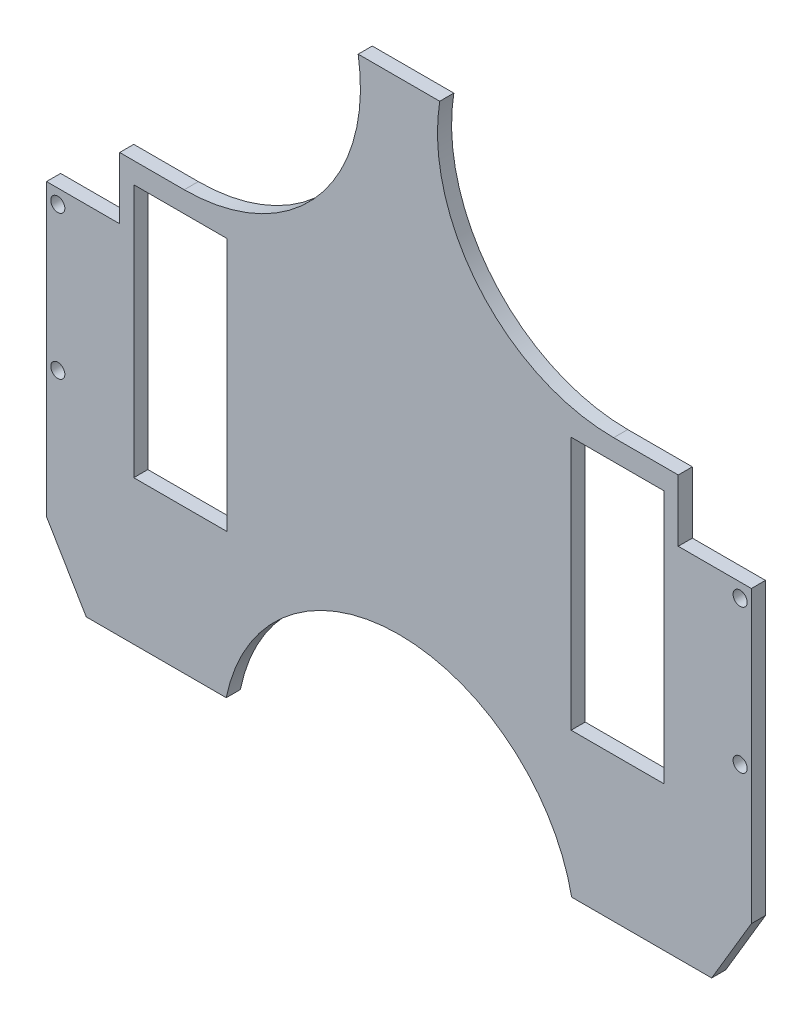
ISO-10303-21;
HEADER;
FILE_DESCRIPTION(('STEP AP214'),'2;1');
FILE_NAME('part.step','',(''),(''),'','','');
FILE_SCHEMA(('AUTOMOTIVE_DESIGN { 1 0 10303 214 1 1 1 1 }'));
ENDSEC;
DATA;
#1=APPLICATION_CONTEXT('core data for automotive mechanical design processes');
#2=APPLICATION_PROTOCOL_DEFINITION('international standard','automotive_design',2000,#1);
#3=PRODUCT_CONTEXT('',#1,'mechanical');
#4=PRODUCT('Part','Part','',(#3));
#5=PRODUCT_RELATED_PRODUCT_CATEGORY('part','',(#4));
#6=PRODUCT_DEFINITION_FORMATION('','',#4);
#7=PRODUCT_DEFINITION_CONTEXT('part definition',#1,'design');
#8=PRODUCT_DEFINITION('design','',#6,#7);
#9=PRODUCT_DEFINITION_SHAPE('','',#8);
#10=(LENGTH_UNIT() NAMED_UNIT(*) SI_UNIT(.MILLI.,.METRE.));
#11=(NAMED_UNIT(*) PLANE_ANGLE_UNIT() SI_UNIT($,.RADIAN.));
#12=(NAMED_UNIT(*) SI_UNIT($,.STERADIAN.) SOLID_ANGLE_UNIT());
#13=UNCERTAINTY_MEASURE_WITH_UNIT(LENGTH_MEASURE(1.E-05),#10,'distance_accuracy_value','');
#14=(GEOMETRIC_REPRESENTATION_CONTEXT(3) GLOBAL_UNCERTAINTY_ASSIGNED_CONTEXT((#13)) GLOBAL_UNIT_ASSIGNED_CONTEXT((#10,
#11,#12)) REPRESENTATION_CONTEXT('',''));
#15=CARTESIAN_POINT('',(0.,0.,0.));
#16=DIRECTION('',(0.,0.,1.));
#17=DIRECTION('',(1.,0.,0.));
#18=AXIS2_PLACEMENT_3D('',#15,#16,#17);
#19=CARTESIAN_POINT('',(0.,0.,5.));
#20=DIRECTION('',(0.,0.,1.));
#21=DIRECTION('',(1.,0.,0.));
#22=AXIS2_PLACEMENT_3D('',#19,#20,#21);
#23=PLANE('',#22);
#24=CARTESIAN_POINT('',(-3247.04194954562,-166.319182093498,5.));
#25=DIRECTION('',(0.,0.,1.));
#26=DIRECTION('',(-1.,0.,0.));
#27=AXIS2_PLACEMENT_3D('',#24,#25,#26);
#28=CIRCLE('',#27,2.50000000000012);
#29=CARTESIAN_POINT('',(-3249.54194954562,-166.319182093498,5.));
#30=VERTEX_POINT('',#29);
#31=EDGE_CURVE('E363',#30,#30,#28,.T.);
#32=ORIENTED_EDGE('',*,*,#31,.F.);
#33=EDGE_LOOP('',(#32));
#34=FACE_BOUND('',#33,.T.);
#35=CARTESIAN_POINT('',(-3489.04194954562,-217.319182093498,5.));
#36=DIRECTION('',(0.,0.,1.));
#37=DIRECTION('',(1.,0.,0.));
#38=AXIS2_PLACEMENT_3D('',#35,#36,#37);
#39=CIRCLE('',#38,2.50000000000012);
#40=CARTESIAN_POINT('',(-3486.54194954562,-217.319182093498,5.));
#41=VERTEX_POINT('',#40);
#42=EDGE_CURVE('E375',#41,#41,#39,.T.);
#43=ORIENTED_EDGE('',*,*,#42,.F.);
#44=EDGE_LOOP('',(#43));
#45=FACE_BOUND('',#44,.T.);
#46=DIRECTION('',(0.,-1.,0.));
#47=VECTOR('',#46,1.);
#48=CARTESIAN_POINT('',(-3462.10194954562,-146.819182093498,5.));
#49=LINE('',#48,#47);
#50=CARTESIAN_POINT('',(-3462.10194954562,-146.819182093498,5.));
#51=VERTEX_POINT('',#50);
#52=CARTESIAN_POINT('',(-3462.10194954562,-236.819182093498,5.));
#53=VERTEX_POINT('',#52);
#54=EDGE_CURVE('E383',#51,#53,#49,.T.);
#55=ORIENTED_EDGE('',*,*,#54,.F.);
#56=DIRECTION('',(-1.,0.,0.));
#57=VECTOR('',#56,1.);
#58=CARTESIAN_POINT('',(-3462.10194954562,-146.819182093498,5.));
#59=LINE('',#58,#57);
#60=CARTESIAN_POINT('',(-3429.10194954562,-146.819182093498,5.));
#61=VERTEX_POINT('',#60);
#62=EDGE_CURVE('E381',#61,#51,#59,.T.);
#63=ORIENTED_EDGE('',*,*,#62,.F.);
#64=DIRECTION('',(0.,1.,0.));
#65=VECTOR('',#64,1.);
#66=CARTESIAN_POINT('',(-3429.10194954562,-146.819182093498,5.));
#67=LINE('',#66,#65);
#68=CARTESIAN_POINT('',(-3429.10194954562,-236.819182093498,5.));
#69=VERTEX_POINT('',#68);
#70=EDGE_CURVE('E389',#69,#61,#67,.T.);
#71=ORIENTED_EDGE('',*,*,#70,.F.);
#72=DIRECTION('',(1.,0.,0.));
#73=VECTOR('',#72,1.);
#74=CARTESIAN_POINT('',(-3462.10194954562,-236.819182093498,5.));
#75=LINE('',#74,#73);
#76=EDGE_CURVE('E386',#53,#69,#75,.T.);
#77=ORIENTED_EDGE('',*,*,#76,.F.);
#78=EDGE_LOOP('',(#55,#63,#71,#77));
#79=FACE_BOUND('',#78,.T.);
#80=CARTESIAN_POINT('',(-3489.04194954562,-166.319182093498,5.));
#81=DIRECTION('',(0.,0.,1.));
#82=DIRECTION('',(1.,0.,0.));
#83=AXIS2_PLACEMENT_3D('',#80,#81,#82);
#84=CIRCLE('',#83,2.50000000000012);
#85=CARTESIAN_POINT('',(-3486.54194954562,-166.319182093498,5.));
#86=VERTEX_POINT('',#85);
#87=EDGE_CURVE('E369',#86,#86,#84,.T.);
#88=ORIENTED_EDGE('',*,*,#87,.F.);
#89=EDGE_LOOP('',(#88));
#90=FACE_BOUND('',#89,.T.);
#91=CARTESIAN_POINT('',(-3247.04194954562,-217.319182093498,5.));
#92=DIRECTION('',(0.,0.,1.));
#93=DIRECTION('',(-1.,0.,0.));
#94=AXIS2_PLACEMENT_3D('',#91,#92,#93);
#95=CIRCLE('',#94,2.50000000000012);
#96=CARTESIAN_POINT('',(-3249.54194954562,-217.319182093498,5.));
#97=VERTEX_POINT('',#96);
#98=EDGE_CURVE('E357',#97,#97,#95,.T.);
#99=ORIENTED_EDGE('',*,*,#98,.F.);
#100=EDGE_LOOP('',(#99));
#101=FACE_BOUND('',#100,.T.);
#102=DIRECTION('',(0.,-1.,0.));
#103=VECTOR('',#102,1.);
#104=CARTESIAN_POINT('',(-3306.98194954562,-146.819182093498,5.));
#105=LINE('',#104,#103);
#106=CARTESIAN_POINT('',(-3306.98194954562,-146.819182093498,5.));
#107=VERTEX_POINT('',#106);
#108=CARTESIAN_POINT('',(-3306.98194954562,-236.819182093498,5.));
#109=VERTEX_POINT('',#108);
#110=EDGE_CURVE('E328',#107,#109,#105,.T.);
#111=ORIENTED_EDGE('',*,*,#110,.F.);
#112=DIRECTION('',(-1.,0.,0.));
#113=VECTOR('',#112,1.);
#114=CARTESIAN_POINT('',(-3273.98194954562,-146.819182093498,5.));
#115=LINE('',#114,#113);
#116=CARTESIAN_POINT('',(-3273.98194954562,-146.819182093498,5.));
#117=VERTEX_POINT('',#116);
#118=EDGE_CURVE('E326',#117,#107,#115,.T.);
#119=ORIENTED_EDGE('',*,*,#118,.F.);
#120=DIRECTION('',(0.,1.,0.));
#121=VECTOR('',#120,1.);
#122=CARTESIAN_POINT('',(-3273.98194954562,-146.819182093498,5.));
#123=LINE('',#122,#121);
#124=CARTESIAN_POINT('',(-3273.98194954562,-236.819182093498,5.));
#125=VERTEX_POINT('',#124);
#126=EDGE_CURVE('E334',#125,#117,#123,.T.);
#127=ORIENTED_EDGE('',*,*,#126,.F.);
#128=DIRECTION('',(1.,0.,0.));
#129=VECTOR('',#128,1.);
#130=CARTESIAN_POINT('',(-3273.98194954562,-236.819182093498,5.));
#131=LINE('',#130,#129);
#132=EDGE_CURVE('E331',#109,#125,#131,.T.);
#133=ORIENTED_EDGE('',*,*,#132,.F.);
#134=EDGE_LOOP('',(#111,#119,#127,#133));
#135=FACE_BOUND('',#134,.T.);
#136=DIRECTION('',(0.,-1.,0.));
#137=VECTOR('',#136,1.);
#138=CARTESIAN_POINT('',(-3493.04194954562,-66.9191820934982,5.));
#139=LINE('',#138,#137);
#140=CARTESIAN_POINT('',(-3493.04194954562,-161.319182093498,5.));
#141=VERTEX_POINT('',#140);
#142=CARTESIAN_POINT('',(-3493.04194954562,-264.270843991495,5.));
#143=VERTEX_POINT('',#142);
#144=EDGE_CURVE('E241',#141,#143,#139,.T.);
#145=ORIENTED_EDGE('',*,*,#144,.T.);
#146=DIRECTION('',(-0.510309234892407,0.859990979477998,0.));
#147=VECTOR('',#146,1.);
#148=CARTESIAN_POINT('',(-3493.04194954562,-264.270843991495,5.));
#149=LINE('',#148,#147);
#150=CARTESIAN_POINT('',(-3478.95845260393,-288.004845850017,5.));
#151=VERTEX_POINT('',#150);
#152=EDGE_CURVE('E263',#151,#143,#149,.T.);
#153=ORIENTED_EDGE('',*,*,#152,.F.);
#154=DIRECTION('',(1.,0.,0.));
#155=VECTOR('',#154,1.);
#156=CARTESIAN_POINT('',(-3493.04194954562,-288.004845850017,5.));
#157=LINE('',#156,#155);
#158=CARTESIAN_POINT('',(-3429.29700036213,-288.004845850017,5.));
#159=VERTEX_POINT('',#158);
#160=EDGE_CURVE('E221',#151,#159,#157,.T.);
#161=ORIENTED_EDGE('',*,*,#160,.T.);
#162=CARTESIAN_POINT('',(-3368.04194954562,-300.417289181909,5.));
#163=DIRECTION('',(0.,0.,1.));
#164=DIRECTION('',(1.,0.,0.));
#165=AXIS2_PLACEMENT_3D('',#162,#163,#164);
#166=CIRCLE('',#165,62.4999999999998);
#167=CARTESIAN_POINT('',(-3306.78689872912,-288.004845850017,5.));
#168=VERTEX_POINT('',#167);
#169=EDGE_CURVE('E49',#168,#159,#166,.T.);
#170=ORIENTED_EDGE('',*,*,#169,.F.);
#171=CARTESIAN_POINT('',(-3257.12544648731,-288.004845850017,5.));
#172=VERTEX_POINT('',#171);
#173=EDGE_CURVE('E215',#168,#172,#157,.T.);
#174=ORIENTED_EDGE('',*,*,#173,.T.);
#175=DIRECTION('',(-0.510309234892419,-0.859990979477991,0.));
#176=VECTOR('',#175,1.);
#177=CARTESIAN_POINT('',(-3243.04194954562,-264.270843991495,5.));
#178=LINE('',#177,#176);
#179=CARTESIAN_POINT('',(-3243.04194954562,-264.270843991495,5.));
#180=VERTEX_POINT('',#179);
#181=EDGE_CURVE('E197',#180,#172,#178,.T.);
#182=ORIENTED_EDGE('',*,*,#181,.F.);
#183=DIRECTION('',(0.,1.,0.));
#184=VECTOR('',#183,1.);
#185=CARTESIAN_POINT('',(-3243.04194954562,-66.9191820934982,5.));
#186=LINE('',#185,#184);
#187=CARTESIAN_POINT('',(-3243.04194954562,-161.319182093498,5.));
#188=VERTEX_POINT('',#187);
#189=EDGE_CURVE('E213',#180,#188,#186,.T.);
#190=ORIENTED_EDGE('',*,*,#189,.T.);
#191=DIRECTION('',(1.,0.,0.));
#192=VECTOR('',#191,1.);
#193=CARTESIAN_POINT('',(-3243.04194954562,-161.319182093498,5.));
#194=LINE('',#193,#192);
#195=CARTESIAN_POINT('',(-3268.98194954562,-161.319182093498,5.));
#196=VERTEX_POINT('',#195);
#197=EDGE_CURVE('E274',#196,#188,#194,.T.);
#198=ORIENTED_EDGE('',*,*,#197,.F.);
#199=DIRECTION('',(0.,-1.,0.));
#200=VECTOR('',#199,1.);
#201=CARTESIAN_POINT('',(-3268.98194954562,-161.319182093498,5.));
#202=LINE('',#201,#200);
#203=CARTESIAN_POINT('',(-3268.98194954562,-139.419182093498,5.));
#204=VERTEX_POINT('',#203);
#205=EDGE_CURVE('E272',#204,#196,#202,.T.);
#206=ORIENTED_EDGE('',*,*,#205,.F.);
#207=DIRECTION('',(1.,0.,0.));
#208=VECTOR('',#207,1.);
#209=CARTESIAN_POINT('',(-3268.98194954562,-139.419182093498,5.));
#210=LINE('',#209,#208);
#211=CARTESIAN_POINT('',(-3291.88530859829,-139.419182093498,5.));
#212=VERTEX_POINT('',#211);
#213=EDGE_CURVE('E269',#212,#204,#210,.T.);
#214=ORIENTED_EDGE('',*,*,#213,.F.);
#215=CARTESIAN_POINT('',(-3291.88530859829,-76.9191820934982,5.));
#216=DIRECTION('',(0.,0.,1.));
#217=DIRECTION('',(-1.,0.,0.));
#218=AXIS2_PLACEMENT_3D('',#215,#216,#217);
#219=CIRCLE('',#218,62.4999999999999);
#220=CARTESIAN_POINT('',(-3353.58012199456,-66.9191820934983,5.));
#221=VERTEX_POINT('',#220);
#222=EDGE_CURVE('E267',#221,#212,#219,.T.);
#223=ORIENTED_EDGE('',*,*,#222,.F.);
#224=DIRECTION('',(-1.,0.,0.));
#225=VECTOR('',#224,1.);
#226=CARTESIAN_POINT('',(-3493.04194954562,-66.9191820934982,5.));
#227=LINE('',#226,#225);
#228=CARTESIAN_POINT('',(-3382.50377709669,-66.9191820934982,5.));
#229=VERTEX_POINT('',#228);
#230=EDGE_CURVE('E220',#221,#229,#227,.T.);
#231=ORIENTED_EDGE('',*,*,#230,.T.);
#232=CARTESIAN_POINT('',(-3444.19859049295,-76.9191820934982,5.));
#233=DIRECTION('',(0.,0.,1.));
#234=DIRECTION('',(1.,0.,0.));
#235=AXIS2_PLACEMENT_3D('',#232,#233,#234);
#236=CIRCLE('',#235,62.4999999999999);
#237=CARTESIAN_POINT('',(-3444.19859049295,-139.419182093498,5.));
#238=VERTEX_POINT('',#237);
#239=EDGE_CURVE('E304',#238,#229,#236,.T.);
#240=ORIENTED_EDGE('',*,*,#239,.F.);
#241=DIRECTION('',(1.,0.,0.));
#242=VECTOR('',#241,1.);
#243=CARTESIAN_POINT('',(-3467.10194954562,-139.419182093498,5.));
#244=LINE('',#243,#242);
#245=CARTESIAN_POINT('',(-3467.10194954562,-139.419182093498,5.));
#246=VERTEX_POINT('',#245);
#247=EDGE_CURVE('E302',#246,#238,#244,.T.);
#248=ORIENTED_EDGE('',*,*,#247,.F.);
#249=DIRECTION('',(0.,1.,0.));
#250=VECTOR('',#249,1.);
#251=CARTESIAN_POINT('',(-3467.10194954562,-161.319182093498,5.));
#252=LINE('',#251,#250);
#253=CARTESIAN_POINT('',(-3467.10194954562,-161.319182093498,5.));
#254=VERTEX_POINT('',#253);
#255=EDGE_CURVE('E299',#254,#246,#252,.T.);
#256=ORIENTED_EDGE('',*,*,#255,.F.);
#257=DIRECTION('',(1.,0.,0.));
#258=VECTOR('',#257,1.);
#259=CARTESIAN_POINT('',(-3493.04194954562,-161.319182093498,5.));
#260=LINE('',#259,#258);
#261=EDGE_CURVE('E297',#141,#254,#260,.T.);
#262=ORIENTED_EDGE('',*,*,#261,.F.);
#263=EDGE_LOOP('',(#145,#153,#161,#170,#174,#182,#190,#198,#206,#214,#223,#231,#240,#248,#256,#262));
#264=FACE_BOUND('',#263,.T.);
#265=ADVANCED_FACE('F35',(#34,#45,#79,#90,#101,#135,#264),#23,.T.);
#266=CARTESIAN_POINT('',(0.,0.,0.));
#267=DIRECTION('',(0.,0.,1.));
#268=DIRECTION('',(1.,0.,0.));
#269=AXIS2_PLACEMENT_3D('',#266,#267,#268);
#270=PLANE('',#269);
#271=DIRECTION('',(-1.,0.,0.));
#272=VECTOR('',#271,1.);
#273=CARTESIAN_POINT('',(-3273.98194954562,-146.819182093498,0.));
#274=LINE('',#273,#272);
#275=CARTESIAN_POINT('',(-3273.98194954562,-146.819182093498,0.));
#276=VERTEX_POINT('',#275);
#277=CARTESIAN_POINT('',(-3306.98194954562,-146.819182093498,0.));
#278=VERTEX_POINT('',#277);
#279=EDGE_CURVE('E325',#276,#278,#274,.T.);
#280=ORIENTED_EDGE('',*,*,#279,.T.);
#281=DIRECTION('',(0.,-1.,0.));
#282=VECTOR('',#281,1.);
#283=CARTESIAN_POINT('',(-3306.98194954562,-146.819182093498,0.));
#284=LINE('',#283,#282);
#285=CARTESIAN_POINT('',(-3306.98194954562,-236.819182093498,0.));
#286=VERTEX_POINT('',#285);
#287=EDGE_CURVE('E339',#278,#286,#284,.T.);
#288=ORIENTED_EDGE('',*,*,#287,.T.);
#289=DIRECTION('',(1.,0.,0.));
#290=VECTOR('',#289,1.);
#291=CARTESIAN_POINT('',(-3273.98194954562,-236.819182093498,0.));
#292=LINE('',#291,#290);
#293=CARTESIAN_POINT('',(-3273.98194954562,-236.819182093498,0.));
#294=VERTEX_POINT('',#293);
#295=EDGE_CURVE('E342',#286,#294,#292,.T.);
#296=ORIENTED_EDGE('',*,*,#295,.T.);
#297=DIRECTION('',(0.,1.,0.));
#298=VECTOR('',#297,1.);
#299=CARTESIAN_POINT('',(-3273.98194954562,-146.819182093498,0.));
#300=LINE('',#299,#298);
#301=EDGE_CURVE('E329',#294,#276,#300,.T.);
#302=ORIENTED_EDGE('',*,*,#301,.T.);
#303=EDGE_LOOP('',(#280,#288,#296,#302));
#304=FACE_BOUND('',#303,.T.);
#305=DIRECTION('',(-1.,0.,0.));
#306=VECTOR('',#305,1.);
#307=CARTESIAN_POINT('',(-3462.10194954562,-146.819182093498,0.));
#308=LINE('',#307,#306);
#309=CARTESIAN_POINT('',(-3429.10194954562,-146.819182093498,0.));
#310=VERTEX_POINT('',#309);
#311=CARTESIAN_POINT('',(-3462.10194954562,-146.819182093498,0.));
#312=VERTEX_POINT('',#311);
#313=EDGE_CURVE('E378',#310,#312,#308,.T.);
#314=ORIENTED_EDGE('',*,*,#313,.T.);
#315=DIRECTION('',(0.,-1.,0.));
#316=VECTOR('',#315,1.);
#317=CARTESIAN_POINT('',(-3462.10194954562,-146.819182093498,0.));
#318=LINE('',#317,#316);
#319=CARTESIAN_POINT('',(-3462.10194954562,-236.819182093498,0.));
#320=VERTEX_POINT('',#319);
#321=EDGE_CURVE('E394',#312,#320,#318,.T.);
#322=ORIENTED_EDGE('',*,*,#321,.T.);
#323=DIRECTION('',(1.,0.,0.));
#324=VECTOR('',#323,1.);
#325=CARTESIAN_POINT('',(-3462.10194954562,-236.819182093498,0.));
#326=LINE('',#325,#324);
#327=CARTESIAN_POINT('',(-3429.10194954562,-236.819182093498,0.));
#328=VERTEX_POINT('',#327);
#329=EDGE_CURVE('E397',#320,#328,#326,.T.);
#330=ORIENTED_EDGE('',*,*,#329,.T.);
#331=DIRECTION('',(0.,1.,0.));
#332=VECTOR('',#331,1.);
#333=CARTESIAN_POINT('',(-3429.10194954562,-146.819182093498,0.));
#334=LINE('',#333,#332);
#335=EDGE_CURVE('E384',#328,#310,#334,.T.);
#336=ORIENTED_EDGE('',*,*,#335,.T.);
#337=EDGE_LOOP('',(#314,#322,#330,#336));
#338=FACE_BOUND('',#337,.T.);
#339=CARTESIAN_POINT('',(-3489.04194954562,-217.319182093498,0.));
#340=DIRECTION('',(0.,0.,1.));
#341=DIRECTION('',(1.,0.,0.));
#342=AXIS2_PLACEMENT_3D('',#339,#340,#341);
#343=CIRCLE('',#342,2.50000000000012);
#344=CARTESIAN_POINT('',(-3486.54194954562,-217.319182093498,0.));
#345=VERTEX_POINT('',#344);
#346=EDGE_CURVE('E372',#345,#345,#343,.T.);
#347=ORIENTED_EDGE('',*,*,#346,.T.);
#348=EDGE_LOOP('',(#347));
#349=FACE_BOUND('',#348,.T.);
#350=CARTESIAN_POINT('',(-3489.04194954562,-166.319182093498,0.));
#351=DIRECTION('',(0.,0.,1.));
#352=DIRECTION('',(1.,0.,0.));
#353=AXIS2_PLACEMENT_3D('',#350,#351,#352);
#354=CIRCLE('',#353,2.50000000000012);
#355=CARTESIAN_POINT('',(-3486.54194954562,-166.319182093498,0.));
#356=VERTEX_POINT('',#355);
#357=EDGE_CURVE('E366',#356,#356,#354,.T.);
#358=ORIENTED_EDGE('',*,*,#357,.T.);
#359=EDGE_LOOP('',(#358));
#360=FACE_BOUND('',#359,.T.);
#361=CARTESIAN_POINT('',(-3247.04194954562,-166.319182093498,0.));
#362=DIRECTION('',(0.,0.,1.));
#363=DIRECTION('',(-1.,0.,0.));
#364=AXIS2_PLACEMENT_3D('',#361,#362,#363);
#365=CIRCLE('',#364,2.50000000000012);
#366=CARTESIAN_POINT('',(-3249.54194954562,-166.319182093498,0.));
#367=VERTEX_POINT('',#366);
#368=EDGE_CURVE('E360',#367,#367,#365,.T.);
#369=ORIENTED_EDGE('',*,*,#368,.T.);
#370=EDGE_LOOP('',(#369));
#371=FACE_BOUND('',#370,.T.);
#372=CARTESIAN_POINT('',(-3247.04194954562,-217.319182093498,0.));
#373=DIRECTION('',(0.,0.,1.));
#374=DIRECTION('',(-1.,0.,0.));
#375=AXIS2_PLACEMENT_3D('',#372,#373,#374);
#376=CIRCLE('',#375,2.50000000000012);
#377=CARTESIAN_POINT('',(-3249.54194954562,-217.319182093498,0.));
#378=VERTEX_POINT('',#377);
#379=EDGE_CURVE('E356',#378,#378,#376,.T.);
#380=ORIENTED_EDGE('',*,*,#379,.T.);
#381=EDGE_LOOP('',(#380));
#382=FACE_BOUND('',#381,.T.);
#383=DIRECTION('',(-0.510309234892407,0.859990979477998,0.));
#384=VECTOR('',#383,1.);
#385=CARTESIAN_POINT('',(-3493.04194954562,-264.270843991495,0.));
#386=LINE('',#385,#384);
#387=CARTESIAN_POINT('',(-3478.95845260393,-288.004845850017,0.));
#388=VERTEX_POINT('',#387);
#389=CARTESIAN_POINT('',(-3493.04194954562,-264.270843991495,0.));
#390=VERTEX_POINT('',#389);
#391=EDGE_CURVE('E57',#388,#390,#386,.T.);
#392=ORIENTED_EDGE('',*,*,#391,.T.);
#393=DIRECTION('',(0.,-1.,0.));
#394=VECTOR('',#393,1.);
#395=CARTESIAN_POINT('',(-3493.04194954562,-66.9191820934982,0.));
#396=LINE('',#395,#394);
#397=CARTESIAN_POINT('',(-3493.04194954562,-161.319182093498,0.));
#398=VERTEX_POINT('',#397);
#399=EDGE_CURVE('E229',#398,#390,#396,.T.);
#400=ORIENTED_EDGE('',*,*,#399,.F.);
#401=DIRECTION('',(1.,0.,0.));
#402=VECTOR('',#401,1.);
#403=CARTESIAN_POINT('',(-3493.04194954562,-161.319182093498,0.));
#404=LINE('',#403,#402);
#405=CARTESIAN_POINT('',(-3467.10194954562,-161.319182093498,0.));
#406=VERTEX_POINT('',#405);
#407=EDGE_CURVE('E257',#398,#406,#404,.T.);
#408=ORIENTED_EDGE('',*,*,#407,.T.);
#409=DIRECTION('',(0.,1.,0.));
#410=VECTOR('',#409,1.);
#411=CARTESIAN_POINT('',(-3467.10194954562,-161.319182093498,0.));
#412=LINE('',#411,#410);
#413=CARTESIAN_POINT('',(-3467.10194954562,-139.419182093498,0.));
#414=VERTEX_POINT('',#413);
#415=EDGE_CURVE('E261',#406,#414,#412,.T.);
#416=ORIENTED_EDGE('',*,*,#415,.T.);
#417=DIRECTION('',(1.,0.,0.));
#418=VECTOR('',#417,1.);
#419=CARTESIAN_POINT('',(-3467.10194954562,-139.419182093498,0.));
#420=LINE('',#419,#418);
#421=CARTESIAN_POINT('',(-3444.19859049295,-139.419182093498,0.));
#422=VERTEX_POINT('',#421);
#423=EDGE_CURVE('E309',#414,#422,#420,.T.);
#424=ORIENTED_EDGE('',*,*,#423,.T.);
#425=CARTESIAN_POINT('',(-3444.19859049295,-76.9191820934982,0.));
#426=DIRECTION('',(0.,0.,1.));
#427=DIRECTION('',(1.,0.,0.));
#428=AXIS2_PLACEMENT_3D('',#425,#426,#427);
#429=CIRCLE('',#428,62.4999999999999);
#430=CARTESIAN_POINT('',(-3382.50377709669,-66.9191820934982,0.));
#431=VERTEX_POINT('',#430);
#432=EDGE_CURVE('E300',#422,#431,#429,.T.);
#433=ORIENTED_EDGE('',*,*,#432,.T.);
#434=DIRECTION('',(-1.,0.,0.));
#435=VECTOR('',#434,1.);
#436=CARTESIAN_POINT('',(-3493.04194954562,-66.9191820934982,0.));
#437=LINE('',#436,#435);
#438=CARTESIAN_POINT('',(-3353.58012199456,-66.9191820934982,0.));
#439=VERTEX_POINT('',#438);
#440=EDGE_CURVE('E239',#439,#431,#437,.T.);
#441=ORIENTED_EDGE('',*,*,#440,.F.);
#442=CARTESIAN_POINT('',(-3291.88530859829,-76.9191820934982,0.));
#443=DIRECTION('',(0.,0.,1.));
#444=DIRECTION('',(-1.,0.,0.));
#445=AXIS2_PLACEMENT_3D('',#442,#443,#444);
#446=CIRCLE('',#445,62.4999999999999);
#447=CARTESIAN_POINT('',(-3291.88530859829,-139.419182093498,0.));
#448=VERTEX_POINT('',#447);
#449=EDGE_CURVE('E205',#439,#448,#446,.T.);
#450=ORIENTED_EDGE('',*,*,#449,.T.);
#451=DIRECTION('',(1.,0.,0.));
#452=VECTOR('',#451,1.);
#453=CARTESIAN_POINT('',(-3268.98194954562,-139.419182093498,0.));
#454=LINE('',#453,#452);
#455=CARTESIAN_POINT('',(-3268.98194954562,-139.419182093498,0.));
#456=VERTEX_POINT('',#455);
#457=EDGE_CURVE('E279',#448,#456,#454,.T.);
#458=ORIENTED_EDGE('',*,*,#457,.T.);
#459=DIRECTION('',(0.,-1.,0.));
#460=VECTOR('',#459,1.);
#461=CARTESIAN_POINT('',(-3268.98194954562,-161.319182093498,0.));
#462=LINE('',#461,#460);
#463=CARTESIAN_POINT('',(-3268.98194954562,-161.319182093498,0.));
#464=VERTEX_POINT('',#463);
#465=EDGE_CURVE('E282',#456,#464,#462,.T.);
#466=ORIENTED_EDGE('',*,*,#465,.T.);
#467=DIRECTION('',(1.,0.,0.));
#468=VECTOR('',#467,1.);
#469=CARTESIAN_POINT('',(-3243.04194954562,-161.319182093498,0.));
#470=LINE('',#469,#468);
#471=CARTESIAN_POINT('',(-3243.04194954562,-161.319182093498,0.));
#472=VERTEX_POINT('',#471);
#473=EDGE_CURVE('E270',#464,#472,#470,.T.);
#474=ORIENTED_EDGE('',*,*,#473,.T.);
#475=DIRECTION('',(0.,1.,0.));
#476=VECTOR('',#475,1.);
#477=CARTESIAN_POINT('',(-3243.04194954562,-66.9191820934982,0.));
#478=LINE('',#477,#476);
#479=CARTESIAN_POINT('',(-3243.04194954562,-264.270843991495,0.));
#480=VERTEX_POINT('',#479);
#481=EDGE_CURVE('E237',#480,#472,#478,.T.);
#482=ORIENTED_EDGE('',*,*,#481,.F.);
#483=DIRECTION('',(-0.510309234892419,-0.859990979477991,0.));
#484=VECTOR('',#483,1.);
#485=CARTESIAN_POINT('',(-3243.04194954562,-264.270843991495,0.));
#486=LINE('',#485,#484);
#487=CARTESIAN_POINT('',(-3257.12544648731,-288.004845850017,0.));
#488=VERTEX_POINT('',#487);
#489=EDGE_CURVE('E200',#480,#488,#486,.T.);
#490=ORIENTED_EDGE('',*,*,#489,.T.);
#491=DIRECTION('',(1.,0.,0.));
#492=VECTOR('',#491,1.);
#493=CARTESIAN_POINT('',(-3493.04194954562,-288.004845850017,0.));
#494=LINE('',#493,#492);
#495=CARTESIAN_POINT('',(-3306.78689872912,-288.004845850017,0.));
#496=VERTEX_POINT('',#495);
#497=EDGE_CURVE('E232',#496,#488,#494,.T.);
#498=ORIENTED_EDGE('',*,*,#497,.F.);
#499=CARTESIAN_POINT('',(-3368.04194954562,-300.417289181909,0.));
#500=DIRECTION('',(0.,0.,1.));
#501=DIRECTION('',(1.,0.,0.));
#502=AXIS2_PLACEMENT_3D('',#499,#500,#501);
#503=CIRCLE('',#502,62.4999999999998);
#504=CARTESIAN_POINT('',(-3429.29700036213,-288.004845850017,0.));
#505=VERTEX_POINT('',#504);
#506=EDGE_CURVE('E244',#496,#505,#503,.T.);
#507=ORIENTED_EDGE('',*,*,#506,.T.);
#508=EDGE_CURVE('E236',#388,#505,#494,.T.);
#509=ORIENTED_EDGE('',*,*,#508,.F.);
#510=EDGE_LOOP('',(#392,#400,#408,#416,#424,#433,#441,#450,#458,#466,#474,#482,#490,#498,#507,#509));
#511=FACE_BOUND('',#510,.T.);
#512=ADVANCED_FACE('F252',(#304,#338,#349,#360,#371,#382,#511),#270,.F.);
#513=CARTESIAN_POINT('',(-3493.04194954562,-66.9191820934982,5.));
#514=DIRECTION('',(1.,0.,0.));
#515=DIRECTION('',(0.,0.,-1.));
#516=AXIS2_PLACEMENT_3D('',#513,#514,#515);
#517=PLANE('',#516);
#518=DIRECTION('',(0.,0.,-1.));
#519=VECTOR('',#518,1.);
#520=CARTESIAN_POINT('',(-3493.04194954562,-264.270843991495,5.));
#521=LINE('',#520,#519);
#522=EDGE_CURVE('E258',#143,#390,#521,.T.);
#523=ORIENTED_EDGE('',*,*,#522,.F.);
#524=ORIENTED_EDGE('',*,*,#144,.F.);
#525=DIRECTION('',(0.,0.,-1.));
#526=VECTOR('',#525,1.);
#527=CARTESIAN_POINT('',(-3493.04194954562,-161.319182093498,5.));
#528=LINE('',#527,#526);
#529=EDGE_CURVE('E305',#141,#398,#528,.T.);
#530=ORIENTED_EDGE('',*,*,#529,.T.);
#531=ORIENTED_EDGE('',*,*,#399,.T.);
#532=EDGE_LOOP('',(#523,#524,#530,#531));
#533=FACE_BOUND('',#532,.T.);
#534=ADVANCED_FACE('F37',(#533),#517,.F.);
#535=CARTESIAN_POINT('',(-3493.04194954562,-288.004845850017,5.));
#536=DIRECTION('',(0.,1.,0.));
#537=DIRECTION('',(-1.,0.,0.));
#538=AXIS2_PLACEMENT_3D('',#535,#536,#537);
#539=PLANE('',#538);
#540=DIRECTION('',(0.,0.,-1.));
#541=VECTOR('',#540,1.);
#542=CARTESIAN_POINT('',(-3478.95845260393,-288.004845850017,5.));
#543=LINE('',#542,#541);
#544=EDGE_CURVE('E255',#151,#388,#543,.T.);
#545=ORIENTED_EDGE('',*,*,#544,.T.);
#546=ORIENTED_EDGE('',*,*,#508,.T.);
#547=DIRECTION('',(0.,0.,-1.));
#548=VECTOR('',#547,1.);
#549=CARTESIAN_POINT('',(-3429.29700036213,-288.004845850017,5.));
#550=LINE('',#549,#548);
#551=EDGE_CURVE('E43',#159,#505,#550,.T.);
#552=ORIENTED_EDGE('',*,*,#551,.F.);
#553=ORIENTED_EDGE('',*,*,#160,.F.);
#554=EDGE_LOOP('',(#545,#546,#552,#553));
#555=FACE_BOUND('',#554,.T.);
#556=ADVANCED_FACE('F254',(#555),#539,.F.);
#557=DIRECTION('',(0.,0.,-1.));
#558=VECTOR('',#557,1.);
#559=CARTESIAN_POINT('',(-3257.12544648731,-288.004845850017,5.));
#560=LINE('',#559,#558);
#561=EDGE_CURVE('E206',#172,#488,#560,.T.);
#562=ORIENTED_EDGE('',*,*,#561,.F.);
#563=ORIENTED_EDGE('',*,*,#173,.F.);
#564=DIRECTION('',(0.,0.,-1.));
#565=VECTOR('',#564,1.);
#566=CARTESIAN_POINT('',(-3306.78689872912,-288.004845850017,5.));
#567=LINE('',#566,#565);
#568=EDGE_CURVE('E11',#496,#168,#567,.F.);
#569=ORIENTED_EDGE('',*,*,#568,.F.);
#570=ORIENTED_EDGE('',*,*,#497,.T.);
#571=EDGE_LOOP('',(#562,#563,#569,#570));
#572=FACE_BOUND('',#571,.T.);
#573=ADVANCED_FACE('F421',(#572),#539,.F.);
#574=CARTESIAN_POINT('',(-3243.04194954562,-66.9191820934982,5.));
#575=DIRECTION('',(-1.,0.,0.));
#576=DIRECTION('',(0.,0.,1.));
#577=AXIS2_PLACEMENT_3D('',#574,#575,#576);
#578=PLANE('',#577);
#579=DIRECTION('',(0.,0.,-1.));
#580=VECTOR('',#579,1.);
#581=CARTESIAN_POINT('',(-3243.04194954562,-161.319182093498,5.));
#582=LINE('',#581,#580);
#583=EDGE_CURVE('E219',#188,#472,#582,.T.);
#584=ORIENTED_EDGE('',*,*,#583,.F.);
#585=ORIENTED_EDGE('',*,*,#189,.F.);
#586=DIRECTION('',(0.,0.,-1.));
#587=VECTOR('',#586,1.);
#588=CARTESIAN_POINT('',(-3243.04194954562,-264.270843991495,5.));
#589=LINE('',#588,#587);
#590=EDGE_CURVE('E194',#180,#480,#589,.T.);
#591=ORIENTED_EDGE('',*,*,#590,.T.);
#592=ORIENTED_EDGE('',*,*,#481,.T.);
#593=EDGE_LOOP('',(#584,#585,#591,#592));
#594=FACE_BOUND('',#593,.T.);
#595=ADVANCED_FACE('F218',(#594),#578,.F.);
#596=CARTESIAN_POINT('',(-3493.04194954562,-66.9191820934982,5.));
#597=DIRECTION('',(0.,-1.,0.));
#598=DIRECTION('',(1.,0.,0.));
#599=AXIS2_PLACEMENT_3D('',#596,#597,#598);
#600=PLANE('',#599);
#601=DIRECTION('',(0.,0.,-1.));
#602=VECTOR('',#601,1.);
#603=CARTESIAN_POINT('',(-3353.58012199456,-66.9191820934983,5.));
#604=LINE('',#603,#602);
#605=EDGE_CURVE('E276',#221,#439,#604,.T.);
#606=ORIENTED_EDGE('',*,*,#605,.T.);
#607=ORIENTED_EDGE('',*,*,#440,.T.);
#608=DIRECTION('',(0.,0.,-1.));
#609=VECTOR('',#608,1.);
#610=CARTESIAN_POINT('',(-3382.50377709669,-66.9191820934982,5.));
#611=LINE('',#610,#609);
#612=EDGE_CURVE('E316',#229,#431,#611,.T.);
#613=ORIENTED_EDGE('',*,*,#612,.F.);
#614=ORIENTED_EDGE('',*,*,#230,.F.);
#615=EDGE_LOOP('',(#606,#607,#613,#614));
#616=FACE_BOUND('',#615,.T.);
#617=ADVANCED_FACE('F427',(#616),#600,.F.);
#618=CARTESIAN_POINT('',(-3462.10194954562,-146.819182093498,5.));
#619=DIRECTION('',(0.,-1.,0.));
#620=DIRECTION('',(0.,0.,-1.));
#621=AXIS2_PLACEMENT_3D('',#618,#619,#620);
#622=PLANE('',#621);
#623=ORIENTED_EDGE('',*,*,#313,.F.);
#624=DIRECTION('',(0.,0.,-1.));
#625=VECTOR('',#624,1.);
#626=CARTESIAN_POINT('',(-3429.10194954562,-146.819182093498,5.));
#627=LINE('',#626,#625);
#628=EDGE_CURVE('E391',#61,#310,#627,.T.);
#629=ORIENTED_EDGE('',*,*,#628,.F.);
#630=ORIENTED_EDGE('',*,*,#62,.T.);
#631=DIRECTION('',(0.,0.,-1.));
#632=VECTOR('',#631,1.);
#633=CARTESIAN_POINT('',(-3462.10194954562,-146.819182093498,5.));
#634=LINE('',#633,#632);
#635=EDGE_CURVE('E233',#51,#312,#634,.T.);
#636=ORIENTED_EDGE('',*,*,#635,.T.);
#637=EDGE_LOOP('',(#623,#629,#630,#636));
#638=FACE_BOUND('',#637,.T.);
#639=ADVANCED_FACE('F440',(#638),#622,.T.);
#640=CARTESIAN_POINT('',(-3462.10194954562,-146.819182093498,5.));
#641=DIRECTION('',(1.,0.,0.));
#642=DIRECTION('',(0.,0.,-1.));
#643=AXIS2_PLACEMENT_3D('',#640,#641,#642);
#644=PLANE('',#643);
#645=ORIENTED_EDGE('',*,*,#321,.F.);
#646=ORIENTED_EDGE('',*,*,#635,.F.);
#647=ORIENTED_EDGE('',*,*,#54,.T.);
#648=DIRECTION('',(0.,0.,-1.));
#649=VECTOR('',#648,1.);
#650=CARTESIAN_POINT('',(-3462.10194954562,-236.819182093498,5.));
#651=LINE('',#650,#649);
#652=EDGE_CURVE('E406',#53,#320,#651,.T.);
#653=ORIENTED_EDGE('',*,*,#652,.T.);
#654=EDGE_LOOP('',(#645,#646,#647,#653));
#655=FACE_BOUND('',#654,.T.);
#656=ADVANCED_FACE('F448',(#655),#644,.T.);
#657=CARTESIAN_POINT('',(-3462.10194954562,-236.819182093498,5.));
#658=DIRECTION('',(0.,1.,0.));
#659=DIRECTION('',(0.,0.,1.));
#660=AXIS2_PLACEMENT_3D('',#657,#658,#659);
#661=PLANE('',#660);
#662=ORIENTED_EDGE('',*,*,#329,.F.);
#663=ORIENTED_EDGE('',*,*,#652,.F.);
#664=ORIENTED_EDGE('',*,*,#76,.T.);
#665=DIRECTION('',(0.,0.,-1.));
#666=VECTOR('',#665,1.);
#667=CARTESIAN_POINT('',(-3429.10194954562,-236.819182093498,5.));
#668=LINE('',#667,#666);
#669=EDGE_CURVE('E404',#69,#328,#668,.T.);
#670=ORIENTED_EDGE('',*,*,#669,.T.);
#671=EDGE_LOOP('',(#662,#663,#664,#670));
#672=FACE_BOUND('',#671,.T.);
#673=ADVANCED_FACE('F540',(#672),#661,.T.);
#674=CARTESIAN_POINT('',(-3429.10194954562,-146.819182093498,5.));
#675=DIRECTION('',(-1.,0.,0.));
#676=DIRECTION('',(0.,0.,1.));
#677=AXIS2_PLACEMENT_3D('',#674,#675,#676);
#678=PLANE('',#677);
#679=ORIENTED_EDGE('',*,*,#335,.F.);
#680=ORIENTED_EDGE('',*,*,#669,.F.);
#681=ORIENTED_EDGE('',*,*,#70,.T.);
#682=ORIENTED_EDGE('',*,*,#628,.T.);
#683=EDGE_LOOP('',(#679,#680,#681,#682));
#684=FACE_BOUND('',#683,.T.);
#685=ADVANCED_FACE('F536',(#684),#678,.T.);
#686=CARTESIAN_POINT('',(-3489.04194954562,-217.319182093498,5.));
#687=DIRECTION('',(0.,0.,-1.));
#688=DIRECTION('',(-1.,0.,0.));
#689=AXIS2_PLACEMENT_3D('',#686,#687,#688);
#690=CYLINDRICAL_SURFACE('',#689,2.50000000000012);
#691=ORIENTED_EDGE('',*,*,#42,.T.);
#692=EDGE_LOOP('',(#691));
#693=FACE_BOUND('',#692,.T.);
#694=ORIENTED_EDGE('',*,*,#346,.F.);
#695=EDGE_LOOP('',(#694));
#696=FACE_BOUND('',#695,.T.);
#697=ADVANCED_FACE('F532',(#693,#696),#690,.F.);
#698=CARTESIAN_POINT('',(-3489.04194954562,-166.319182093498,5.));
#699=DIRECTION('',(0.,0.,-1.));
#700=DIRECTION('',(-1.,0.,0.));
#701=AXIS2_PLACEMENT_3D('',#698,#699,#700);
#702=CYLINDRICAL_SURFACE('',#701,2.50000000000012);
#703=ORIENTED_EDGE('',*,*,#87,.T.);
#704=EDGE_LOOP('',(#703));
#705=FACE_BOUND('',#704,.T.);
#706=ORIENTED_EDGE('',*,*,#357,.F.);
#707=EDGE_LOOP('',(#706));
#708=FACE_BOUND('',#707,.T.);
#709=ADVANCED_FACE('F528',(#705,#708),#702,.F.);
#710=CARTESIAN_POINT('',(-3247.04194954562,-166.319182093498,5.));
#711=DIRECTION('',(0.,0.,-1.));
#712=DIRECTION('',(-1.,0.,0.));
#713=AXIS2_PLACEMENT_3D('',#710,#711,#712);
#714=CYLINDRICAL_SURFACE('',#713,2.50000000000012);
#715=ORIENTED_EDGE('',*,*,#31,.T.);
#716=EDGE_LOOP('',(#715));
#717=FACE_BOUND('',#716,.T.);
#718=ORIENTED_EDGE('',*,*,#368,.F.);
#719=EDGE_LOOP('',(#718));
#720=FACE_BOUND('',#719,.T.);
#721=ADVANCED_FACE('F524',(#717,#720),#714,.F.);
#722=CARTESIAN_POINT('',(-3247.04194954562,-217.319182093498,5.));
#723=DIRECTION('',(0.,0.,-1.));
#724=DIRECTION('',(-1.,0.,0.));
#725=AXIS2_PLACEMENT_3D('',#722,#723,#724);
#726=CYLINDRICAL_SURFACE('',#725,2.50000000000012);
#727=ORIENTED_EDGE('',*,*,#98,.T.);
#728=EDGE_LOOP('',(#727));
#729=FACE_BOUND('',#728,.T.);
#730=ORIENTED_EDGE('',*,*,#379,.F.);
#731=EDGE_LOOP('',(#730));
#732=FACE_BOUND('',#731,.T.);
#733=ADVANCED_FACE('F520',(#729,#732),#726,.F.);
#734=CARTESIAN_POINT('',(-3273.98194954562,-146.819182093498,5.));
#735=DIRECTION('',(0.,-1.,0.));
#736=DIRECTION('',(0.,0.,-1.));
#737=AXIS2_PLACEMENT_3D('',#734,#735,#736);
#738=PLANE('',#737);
#739=ORIENTED_EDGE('',*,*,#279,.F.);
#740=DIRECTION('',(0.,0.,-1.));
#741=VECTOR('',#740,1.);
#742=CARTESIAN_POINT('',(-3273.98194954562,-146.819182093498,5.));
#743=LINE('',#742,#741);
#744=EDGE_CURVE('E336',#117,#276,#743,.T.);
#745=ORIENTED_EDGE('',*,*,#744,.F.);
#746=ORIENTED_EDGE('',*,*,#118,.T.);
#747=DIRECTION('',(0.,0.,-1.));
#748=VECTOR('',#747,1.);
#749=CARTESIAN_POINT('',(-3306.98194954562,-146.819182093498,5.));
#750=LINE('',#749,#748);
#751=EDGE_CURVE('E353',#107,#278,#750,.T.);
#752=ORIENTED_EDGE('',*,*,#751,.T.);
#753=EDGE_LOOP('',(#739,#745,#746,#752));
#754=FACE_BOUND('',#753,.T.);
#755=ADVANCED_FACE('F516',(#754),#738,.T.);
#756=CARTESIAN_POINT('',(-3306.98194954562,-146.819182093498,5.));
#757=DIRECTION('',(1.,0.,0.));
#758=DIRECTION('',(0.,0.,-1.));
#759=AXIS2_PLACEMENT_3D('',#756,#757,#758);
#760=PLANE('',#759);
#761=ORIENTED_EDGE('',*,*,#287,.F.);
#762=ORIENTED_EDGE('',*,*,#751,.F.);
#763=ORIENTED_EDGE('',*,*,#110,.T.);
#764=DIRECTION('',(0.,0.,-1.));
#765=VECTOR('',#764,1.);
#766=CARTESIAN_POINT('',(-3306.98194954562,-236.819182093498,5.));
#767=LINE('',#766,#765);
#768=EDGE_CURVE('E351',#109,#286,#767,.T.);
#769=ORIENTED_EDGE('',*,*,#768,.T.);
#770=EDGE_LOOP('',(#761,#762,#763,#769));
#771=FACE_BOUND('',#770,.T.);
#772=ADVANCED_FACE('F512',(#771),#760,.T.);
#773=CARTESIAN_POINT('',(-3273.98194954562,-236.819182093498,5.));
#774=DIRECTION('',(0.,1.,0.));
#775=DIRECTION('',(0.,0.,1.));
#776=AXIS2_PLACEMENT_3D('',#773,#774,#775);
#777=PLANE('',#776);
#778=ORIENTED_EDGE('',*,*,#295,.F.);
#779=ORIENTED_EDGE('',*,*,#768,.F.);
#780=ORIENTED_EDGE('',*,*,#132,.T.);
#781=DIRECTION('',(0.,0.,-1.));
#782=VECTOR('',#781,1.);
#783=CARTESIAN_POINT('',(-3273.98194954562,-236.819182093498,5.));
#784=LINE('',#783,#782);
#785=EDGE_CURVE('E349',#125,#294,#784,.T.);
#786=ORIENTED_EDGE('',*,*,#785,.T.);
#787=EDGE_LOOP('',(#778,#779,#780,#786));
#788=FACE_BOUND('',#787,.T.);
#789=ADVANCED_FACE('F508',(#788),#777,.T.);
#790=CARTESIAN_POINT('',(-3273.98194954562,-146.819182093498,5.));
#791=DIRECTION('',(-1.,0.,0.));
#792=DIRECTION('',(0.,0.,1.));
#793=AXIS2_PLACEMENT_3D('',#790,#791,#792);
#794=PLANE('',#793);
#795=ORIENTED_EDGE('',*,*,#301,.F.);
#796=ORIENTED_EDGE('',*,*,#785,.F.);
#797=ORIENTED_EDGE('',*,*,#126,.T.);
#798=ORIENTED_EDGE('',*,*,#744,.T.);
#799=EDGE_LOOP('',(#795,#796,#797,#798));
#800=FACE_BOUND('',#799,.T.);
#801=ADVANCED_FACE('F504',(#800),#794,.T.);
#802=CARTESIAN_POINT('',(-3493.04194954562,-161.319182093498,5.));
#803=DIRECTION('',(0.,1.,0.));
#804=DIRECTION('',(0.,0.,1.));
#805=AXIS2_PLACEMENT_3D('',#802,#803,#804);
#806=PLANE('',#805);
#807=ORIENTED_EDGE('',*,*,#407,.F.);
#808=ORIENTED_EDGE('',*,*,#529,.F.);
#809=ORIENTED_EDGE('',*,*,#261,.T.);
#810=DIRECTION('',(0.,0.,-1.));
#811=VECTOR('',#810,1.);
#812=CARTESIAN_POINT('',(-3467.10194954562,-161.319182093498,5.));
#813=LINE('',#812,#811);
#814=EDGE_CURVE('E322',#254,#406,#813,.T.);
#815=ORIENTED_EDGE('',*,*,#814,.T.);
#816=EDGE_LOOP('',(#807,#808,#809,#815));
#817=FACE_BOUND('',#816,.T.);
#818=ADVANCED_FACE('F500',(#817),#806,.T.);
#819=CARTESIAN_POINT('',(-3467.10194954562,-161.319182093498,5.));
#820=DIRECTION('',(-1.,0.,0.));
#821=DIRECTION('',(0.,0.,1.));
#822=AXIS2_PLACEMENT_3D('',#819,#820,#821);
#823=PLANE('',#822);
#824=ORIENTED_EDGE('',*,*,#415,.F.);
#825=ORIENTED_EDGE('',*,*,#814,.F.);
#826=ORIENTED_EDGE('',*,*,#255,.T.);
#827=DIRECTION('',(0.,0.,-1.));
#828=VECTOR('',#827,1.);
#829=CARTESIAN_POINT('',(-3467.10194954562,-139.419182093498,5.));
#830=LINE('',#829,#828);
#831=EDGE_CURVE('E320',#246,#414,#830,.T.);
#832=ORIENTED_EDGE('',*,*,#831,.T.);
#833=EDGE_LOOP('',(#824,#825,#826,#832));
#834=FACE_BOUND('',#833,.T.);
#835=ADVANCED_FACE('F496',(#834),#823,.T.);
#836=CARTESIAN_POINT('',(-3467.10194954562,-139.419182093498,5.));
#837=DIRECTION('',(0.,1.,0.));
#838=DIRECTION('',(-1.,0.,0.));
#839=AXIS2_PLACEMENT_3D('',#836,#837,#838);
#840=PLANE('',#839);
#841=ORIENTED_EDGE('',*,*,#423,.F.);
#842=ORIENTED_EDGE('',*,*,#831,.F.);
#843=ORIENTED_EDGE('',*,*,#247,.T.);
#844=DIRECTION('',(0.,0.,-1.));
#845=VECTOR('',#844,1.);
#846=CARTESIAN_POINT('',(-3444.19859049295,-139.419182093498,5.));
#847=LINE('',#846,#845);
#848=EDGE_CURVE('E318',#238,#422,#847,.T.);
#849=ORIENTED_EDGE('',*,*,#848,.T.);
#850=EDGE_LOOP('',(#841,#842,#843,#849));
#851=FACE_BOUND('',#850,.T.);
#852=ADVANCED_FACE('F493',(#851),#840,.T.);
#853=CARTESIAN_POINT('',(-3444.19859049295,-76.9191820934982,5.));
#854=DIRECTION('',(0.,0.,-1.));
#855=DIRECTION('',(-1.,0.,0.));
#856=AXIS2_PLACEMENT_3D('',#853,#854,#855);
#857=CYLINDRICAL_SURFACE('',#856,62.4999999999999);
#858=ORIENTED_EDGE('',*,*,#432,.F.);
#859=ORIENTED_EDGE('',*,*,#848,.F.);
#860=ORIENTED_EDGE('',*,*,#239,.T.);
#861=ORIENTED_EDGE('',*,*,#612,.T.);
#862=EDGE_LOOP('',(#858,#859,#860,#861));
#863=FACE_BOUND('',#862,.T.);
#864=ADVANCED_FACE('F459',(#863),#857,.F.);
#865=CARTESIAN_POINT('',(-3291.88530859829,-76.9191820934982,5.));
#866=DIRECTION('',(0.,0.,-1.));
#867=DIRECTION('',(-1.,0.,0.));
#868=AXIS2_PLACEMENT_3D('',#865,#866,#867);
#869=CYLINDRICAL_SURFACE('',#868,62.4999999999999);
#870=ORIENTED_EDGE('',*,*,#449,.F.);
#871=ORIENTED_EDGE('',*,*,#605,.F.);
#872=ORIENTED_EDGE('',*,*,#222,.T.);
#873=DIRECTION('',(0.,0.,-1.));
#874=VECTOR('',#873,1.);
#875=CARTESIAN_POINT('',(-3291.88530859829,-139.419182093498,5.));
#876=LINE('',#875,#874);
#877=EDGE_CURVE('E294',#212,#448,#876,.T.);
#878=ORIENTED_EDGE('',*,*,#877,.T.);
#879=EDGE_LOOP('',(#870,#871,#872,#878));
#880=FACE_BOUND('',#879,.T.);
#881=ADVANCED_FACE('F465',(#880),#869,.F.);
#882=CARTESIAN_POINT('',(-3268.98194954562,-139.419182093498,5.));
#883=DIRECTION('',(0.,1.,0.));
#884=DIRECTION('',(-1.,0.,0.));
#885=AXIS2_PLACEMENT_3D('',#882,#883,#884);
#886=PLANE('',#885);
#887=ORIENTED_EDGE('',*,*,#457,.F.);
#888=ORIENTED_EDGE('',*,*,#877,.F.);
#889=ORIENTED_EDGE('',*,*,#213,.T.);
#890=DIRECTION('',(0.,0.,-1.));
#891=VECTOR('',#890,1.);
#892=CARTESIAN_POINT('',(-3268.98194954562,-139.419182093498,5.));
#893=LINE('',#892,#891);
#894=EDGE_CURVE('E292',#204,#456,#893,.T.);
#895=ORIENTED_EDGE('',*,*,#894,.T.);
#896=EDGE_LOOP('',(#887,#888,#889,#895));
#897=FACE_BOUND('',#896,.T.);
#898=ADVANCED_FACE('F467',(#897),#886,.T.);
#899=CARTESIAN_POINT('',(-3268.98194954562,-161.319182093498,5.));
#900=DIRECTION('',(1.,0.,0.));
#901=DIRECTION('',(0.,0.,-1.));
#902=AXIS2_PLACEMENT_3D('',#899,#900,#901);
#903=PLANE('',#902);
#904=ORIENTED_EDGE('',*,*,#465,.F.);
#905=ORIENTED_EDGE('',*,*,#894,.F.);
#906=ORIENTED_EDGE('',*,*,#205,.T.);
#907=DIRECTION('',(0.,0.,-1.));
#908=VECTOR('',#907,1.);
#909=CARTESIAN_POINT('',(-3268.98194954562,-161.319182093498,5.));
#910=LINE('',#909,#908);
#911=EDGE_CURVE('E290',#196,#464,#910,.T.);
#912=ORIENTED_EDGE('',*,*,#911,.T.);
#913=EDGE_LOOP('',(#904,#905,#906,#912));
#914=FACE_BOUND('',#913,.T.);
#915=ADVANCED_FACE('F472',(#914),#903,.T.);
#916=CARTESIAN_POINT('',(-3243.04194954562,-161.319182093498,5.));
#917=DIRECTION('',(0.,1.,0.));
#918=DIRECTION('',(-1.,0.,0.));
#919=AXIS2_PLACEMENT_3D('',#916,#917,#918);
#920=PLANE('',#919);
#921=ORIENTED_EDGE('',*,*,#473,.F.);
#922=ORIENTED_EDGE('',*,*,#911,.F.);
#923=ORIENTED_EDGE('',*,*,#197,.T.);
#924=ORIENTED_EDGE('',*,*,#583,.T.);
#925=EDGE_LOOP('',(#921,#922,#923,#924));
#926=FACE_BOUND('',#925,.T.);
#927=ADVANCED_FACE('F475',(#926),#920,.T.);
#928=CARTESIAN_POINT('',(-3243.04194954562,-264.270843991495,5.));
#929=DIRECTION('',(0.859990979477991,-0.510309234892419,0.));
#930=DIRECTION('',(0.510309234892419,0.859990979477991,0.));
#931=AXIS2_PLACEMENT_3D('',#928,#929,#930);
#932=PLANE('',#931);
#933=ORIENTED_EDGE('',*,*,#489,.F.);
#934=ORIENTED_EDGE('',*,*,#590,.F.);
#935=ORIENTED_EDGE('',*,*,#181,.T.);
#936=ORIENTED_EDGE('',*,*,#561,.T.);
#937=EDGE_LOOP('',(#933,#934,#935,#936));
#938=FACE_BOUND('',#937,.T.);
#939=ADVANCED_FACE('F196',(#938),#932,.T.);
#940=CARTESIAN_POINT('',(-3368.04194954562,-300.417289181909,5.));
#941=DIRECTION('',(0.,0.,-1.));
#942=DIRECTION('',(-1.,0.,0.));
#943=AXIS2_PLACEMENT_3D('',#940,#941,#942);
#944=CYLINDRICAL_SURFACE('',#943,62.4999999999998);
#945=ORIENTED_EDGE('',*,*,#568,.T.);
#946=ORIENTED_EDGE('',*,*,#169,.T.);
#947=ORIENTED_EDGE('',*,*,#551,.T.);
#948=ORIENTED_EDGE('',*,*,#506,.F.);
#949=EDGE_LOOP('',(#945,#946,#947,#948));
#950=FACE_BOUND('',#949,.T.);
#951=ADVANCED_FACE('F243',(#950),#944,.F.);
#952=CARTESIAN_POINT('',(-3493.04194954562,-264.270843991495,5.));
#953=DIRECTION('',(-0.859990979477998,-0.510309234892407,0.));
#954=DIRECTION('',(0.510309234892407,-0.859990979477998,0.));
#955=AXIS2_PLACEMENT_3D('',#952,#953,#954);
#956=PLANE('',#955);
#957=ORIENTED_EDGE('',*,*,#391,.F.);
#958=ORIENTED_EDGE('',*,*,#544,.F.);
#959=ORIENTED_EDGE('',*,*,#152,.T.);
#960=ORIENTED_EDGE('',*,*,#522,.T.);
#961=EDGE_LOOP('',(#957,#958,#959,#960));
#962=FACE_BOUND('',#961,.T.);
#963=ADVANCED_FACE('F415',(#962),#956,.T.);
#964=CLOSED_SHELL('',(#265,#512,#534,#556,#573,#595,#617,#639,#656,#673,#685,#697,#709,#721,
#733,#755,#772,#789,#801,#818,#835,#852,#864,#881,#898,#915,#927,#939,#951,#963));
#965=MANIFOLD_SOLID_BREP('B2',#964);
#966=ADVANCED_BREP_SHAPE_REPRESENTATION('',(#18,#965),#14);
#967=SHAPE_DEFINITION_REPRESENTATION(#9,#966);
ENDSEC;
END-ISO-10303-21;
